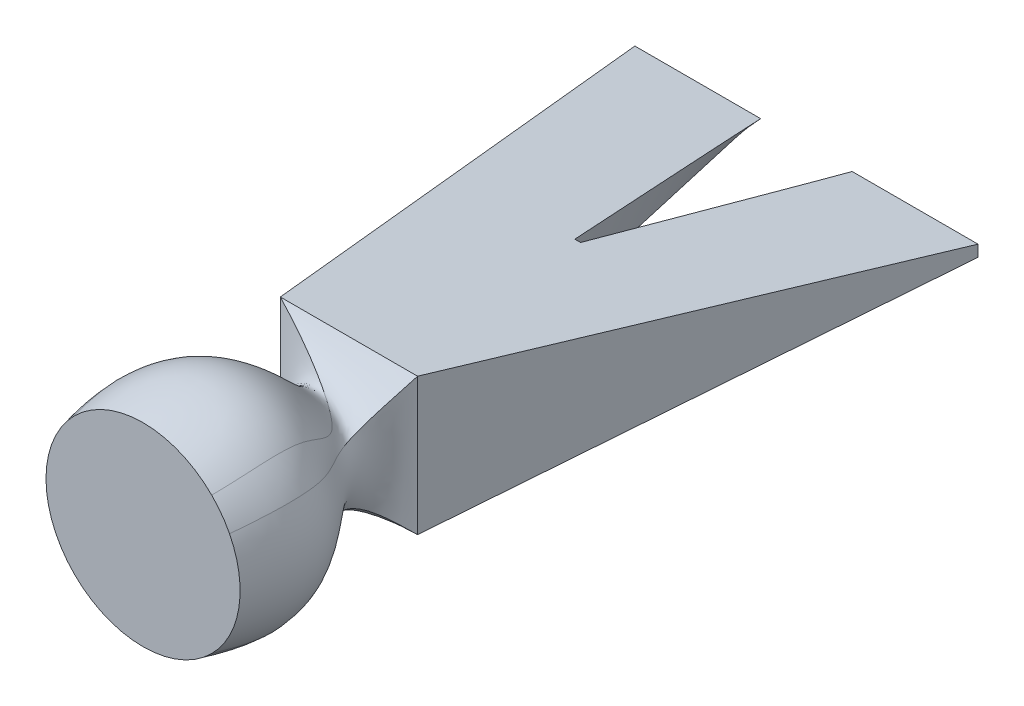
ISO-10303-21;
HEADER;
FILE_DESCRIPTION(('STEP AP214'),'2;1');
FILE_NAME('part.step','',(''),(''),'','','');
FILE_SCHEMA(('AUTOMOTIVE_DESIGN { 1 0 10303 214 1 1 1 1 }'));
ENDSEC;
DATA;
#1=APPLICATION_CONTEXT('core data for automotive mechanical design processes');
#2=APPLICATION_PROTOCOL_DEFINITION('international standard','automotive_design',2000,#1);
#3=PRODUCT_CONTEXT('',#1,'mechanical');
#4=PRODUCT('Part','Part','',(#3));
#5=PRODUCT_RELATED_PRODUCT_CATEGORY('part','',(#4));
#6=PRODUCT_DEFINITION_FORMATION('','',#4);
#7=PRODUCT_DEFINITION_CONTEXT('part definition',#1,'design');
#8=PRODUCT_DEFINITION('design','',#6,#7);
#9=PRODUCT_DEFINITION_SHAPE('','',#8);
#10=(LENGTH_UNIT() NAMED_UNIT(*) SI_UNIT(.MILLI.,.METRE.));
#11=(NAMED_UNIT(*) PLANE_ANGLE_UNIT() SI_UNIT($,.RADIAN.));
#12=(NAMED_UNIT(*) SI_UNIT($,.STERADIAN.) SOLID_ANGLE_UNIT());
#13=UNCERTAINTY_MEASURE_WITH_UNIT(LENGTH_MEASURE(1.E-05),#10,'distance_accuracy_value','');
#14=(GEOMETRIC_REPRESENTATION_CONTEXT(3) GLOBAL_UNCERTAINTY_ASSIGNED_CONTEXT((#13)) GLOBAL_UNIT_ASSIGNED_CONTEXT((#10,
#11,#12)) REPRESENTATION_CONTEXT('',''));
#15=CARTESIAN_POINT('',(0.,0.,0.));
#16=DIRECTION('',(0.,0.,1.));
#17=DIRECTION('',(1.,0.,0.));
#18=AXIS2_PLACEMENT_3D('',#15,#16,#17);
#19=CARTESIAN_POINT('',(0.,0.,-200.));
#20=DIRECTION('',(0.,0.,-1.));
#21=DIRECTION('',(-1.,0.,0.));
#22=AXIS2_PLACEMENT_3D('',#19,#20,#21);
#23=PLANE('',#22);
#24=DIRECTION('',(0.707106781186548,-0.707106781186547,0.));
#25=VECTOR('',#24,1.);
#26=CARTESIAN_POINT('',(25.,-2.5,-200.));
#27=LINE('',#26,#25);
#28=CARTESIAN_POINT('',(20.,2.5,-200.));
#29=VERTEX_POINT('',#28);
#30=CARTESIAN_POINT('',(25.,-2.5,-200.));
#31=VERTEX_POINT('',#30);
#32=EDGE_CURVE('E217',#29,#31,#27,.T.);
#33=ORIENTED_EDGE('',*,*,#32,.F.);
#34=DIRECTION('',(-1.,0.,0.));
#35=VECTOR('',#34,1.);
#36=CARTESIAN_POINT('',(-75.,2.5,-200.));
#37=LINE('',#36,#35);
#38=CARTESIAN_POINT('',(75.,2.5,-200.));
#39=VERTEX_POINT('',#38);
#40=EDGE_CURVE('E376',#39,#29,#37,.T.);
#41=ORIENTED_EDGE('',*,*,#40,.F.);
#42=DIRECTION('',(0.,1.,0.));
#43=VECTOR('',#42,1.);
#44=CARTESIAN_POINT('',(75.,-2.5,-200.));
#45=LINE('',#44,#43);
#46=CARTESIAN_POINT('',(75.,-2.5,-200.));
#47=VERTEX_POINT('',#46);
#48=EDGE_CURVE('E239',#47,#39,#45,.T.);
#49=ORIENTED_EDGE('',*,*,#48,.F.);
#50=DIRECTION('',(1.,0.,0.));
#51=VECTOR('',#50,1.);
#52=CARTESIAN_POINT('',(-75.,-2.5,-200.));
#53=LINE('',#52,#51);
#54=EDGE_CURVE('E140',#31,#47,#53,.T.);
#55=ORIENTED_EDGE('',*,*,#54,.F.);
#56=EDGE_LOOP('',(#33,#41,#49,#55));
#57=FACE_BOUND('',#56,.T.);
#58=ADVANCED_FACE('F135',(#57),#23,.T.);
#59=CARTESIAN_POINT('',(0.,0.,90.));
#60=DIRECTION('',(0.,0.,1.));
#61=DIRECTION('',(1.,0.,0.));
#62=AXIS2_PLACEMENT_3D('',#59,#60,#61);
#63=PLANE('',#62);
#64=CARTESIAN_POINT('',(0.,0.,90.));
#65=DIRECTION('',(0.,0.,1.));
#66=DIRECTION('',(1.,0.,0.));
#67=AXIS2_PLACEMENT_3D('',#64,#65,#66);
#68=CIRCLE('',#67,42.4264068711929);
#69=CARTESIAN_POINT('',(30.,-30.,90.));
#70=VERTEX_POINT('',#69);
#71=CARTESIAN_POINT('',(37.802205320103,19.2611856576062,90.));
#72=VERTEX_POINT('',#71);
#73=EDGE_CURVE('E306',#70,#72,#68,.T.);
#74=ORIENTED_EDGE('',*,*,#73,.T.);
#75=CARTESIAN_POINT('',(30.,30.,90.));
#76=VERTEX_POINT('',#75);
#77=EDGE_CURVE('E434',#72,#76,#68,.T.);
#78=ORIENTED_EDGE('',*,*,#77,.T.);
#79=CARTESIAN_POINT('',(-30.,30.,90.));
#80=VERTEX_POINT('',#79);
#81=EDGE_CURVE('E162',#76,#80,#68,.T.);
#82=ORIENTED_EDGE('',*,*,#81,.T.);
#83=EDGE_CURVE('E436',#80,#70,#68,.T.);
#84=ORIENTED_EDGE('',*,*,#83,.T.);
#85=EDGE_LOOP('',(#74,#78,#82,#84));
#86=FACE_BOUND('',#85,.T.);
#87=ADVANCED_FACE('F137',(#86),#63,.T.);
#88=CARTESIAN_POINT('',(30.,-30.,0.));
#89=CARTESIAN_POINT('',(21.7851130197758,-21.7851130197758,8.33333333333334));
#90=CARTESIAN_POINT('',(10.318060036557,-10.318060036557,21.3529609402473));
#91=CARTESIAN_POINT('',(35.9925378236792,-35.9925378236792,51.829840681137));
#92=CARTESIAN_POINT('',(32.3581604097574,-32.3581604097574,75.7725733783253));
#93=CARTESIAN_POINT('',(30.,-30.,90.));
#94=CARTESIAN_POINT('',(30.,-10.,0.));
#95=CARTESIAN_POINT('',(22.3565062022907,-8.04815958581926,8.22556761468494));
#96=CARTESIAN_POINT('',(17.836087357927,-7.34363097641756,21.3911769978607));
#97=CARTESIAN_POINT('',(50.7921365249769,-19.9767434360095,51.8167924581793));
#98=CARTESIAN_POINT('',(45.55583993278,-18.0741817082814,75.7725733783253));
#99=CARTESIAN_POINT('',(42.9932478375263,-17.0067521624737,90.));
#100=CARTESIAN_POINT('',(30.,10.,0.));
#101=CARTESIAN_POINT('',(22.9278993848056,5.68879384813727,8.11780189603654));
#102=CARTESIAN_POINT('',(19.5237270600727,-0.280369080483714,21.429393055474));
#103=CARTESIAN_POINT('',(54.3798885298079,3.90188442284275,51.8037442352217));
#104=CARTESIAN_POINT('',(48.9114077306492,3.1120395581098,75.7725733783253));
#105=CARTESIAN_POINT('',(46.1443839498992,2.88873823996773,90.));
#106=CARTESIAN_POINT('',(30.,30.,0.));
#107=CARTESIAN_POINT('',(23.4992925673205,19.4257472820938,8.01003617738814));
#108=CARTESIAN_POINT('',(14.4028197910098,4.69587056105987,21.4676091130874));
#109=CARTESIAN_POINT('',(44.8747915077265,23.7671644399179,51.790696012264));
#110=CARTESIAN_POINT('',(40.7736607863493,20.775217839698,75.7725733783253));
#111=CARTESIAN_POINT('',(37.802205320103,19.2611856576062,90.));
#112=B_SPLINE_SURFACE_WITH_KNOTS('',3,3,((#88,#89,#90,#91,#92,#93),(#94,#95,#96,#97,#98,#99),
(#100,#101,#102,#103,#104,#105),(#106,#107,#108,#109,#110,#111)),.UNSPECIFIED.,.F.,.F.,.F.,(4,
4),(4,1,1,4),(0.,1.),(0.,0.357643172453526,0.635409037528455,1.),.UNSPECIFIED.);
#113=DIRECTION('',(0.,1.,0.));
#114=VECTOR('',#113,1.);
#115=CARTESIAN_POINT('',(30.,30.,0.));
#116=LINE('',#115,#114);
#117=CARTESIAN_POINT('',(30.,-30.,0.));
#118=VERTEX_POINT('',#117);
#119=CARTESIAN_POINT('',(30.,30.,0.));
#120=VERTEX_POINT('',#119);
#121=EDGE_CURVE('E457',#118,#120,#116,.T.);
#122=CARTESIAN_POINT('',(30.,30.,0.));
#123=CARTESIAN_POINT('',(23.4992925673205,19.4257472820938,8.01003617738814));
#124=CARTESIAN_POINT('',(14.4028197910098,4.69587056105987,21.4676091130874));
#125=CARTESIAN_POINT('',(44.8747915077265,23.7671644399179,51.790696012264));
#126=CARTESIAN_POINT('',(40.7736607863493,20.775217839698,75.7725733783253));
#127=CARTESIAN_POINT('',(37.802205320103,19.2611856576062,90.));
#128=B_SPLINE_CURVE_WITH_KNOTS('',3,(#122,#123,#124,#125,#126,#127),.UNSPECIFIED.,.F.,.F.,(4,1,
1,4),(0.,0.357643172453526,0.635409037528455,1.),.UNSPECIFIED.);
#129=EDGE_CURVE('E449',#120,#72,#128,.T.);
#130=CARTESIAN_POINT('',(30.,-30.,0.));
#131=CARTESIAN_POINT('',(21.7851130197758,-21.7851130197758,8.33333333333334));
#132=CARTESIAN_POINT('',(10.318060036557,-10.318060036557,21.3529609402473));
#133=CARTESIAN_POINT('',(35.9925378236792,-35.9925378236792,51.829840681137));
#134=CARTESIAN_POINT('',(32.3581604097574,-32.3581604097574,75.7725733783253));
#135=CARTESIAN_POINT('',(30.,-30.,90.));
#136=B_SPLINE_CURVE_WITH_KNOTS('',3,(#130,#131,#132,#133,#134,#135),.UNSPECIFIED.,.F.,.F.,(4,1,
1,4),(0.,0.357643172453526,0.635409037528455,1.),.UNSPECIFIED.);
#137=EDGE_CURVE('E458',#70,#118,#136,.F.);
#138=ORIENTED_EDGE('',*,*,#121,.T.);
#139=ORIENTED_EDGE('',*,*,#129,.T.);
#140=ORIENTED_EDGE('',*,*,#73,.F.);
#141=ORIENTED_EDGE('',*,*,#137,.T.);
#142=EDGE_LOOP('',(#138,#139,#140,#141));
#143=FACE_BOUND('',#142,.T.);
#144=ADVANCED_FACE('F424',(#143),#112,.T.);
#145=CARTESIAN_POINT('',(30.,30.,0.));
#146=CARTESIAN_POINT('',(23.4992925673205,19.4257472820938,8.01003617738814));
#147=CARTESIAN_POINT('',(14.4028197910098,4.69587056105988,21.4676091130874));
#148=CARTESIAN_POINT('',(44.8747915077265,23.767164439918,51.790696012264));
#149=CARTESIAN_POINT('',(40.7736607863493,20.775217839698,75.7725733783253));
#150=CARTESIAN_POINT('',(37.802205320103,19.2611856576062,90.));
#151=CARTESIAN_POINT('',(10.,30.,0.));
#152=CARTESIAN_POINT('',(11.7687079402375,20.2122025279878,7.15180902556312));
#153=CARTESIAN_POINT('',(17.3418714400447,6.79925244432722,21.7719550469414));
#154=CARTESIAN_POINT('',(41.2231480755875,28.2832692535335,51.6867822689533));
#155=CARTESIAN_POINT('',(38.5480887905122,25.0233051217613,75.7725733783253));
#156=CARTESIAN_POINT('',(35.7810650097622,23.227896863781,90.));
#157=CARTESIAN_POINT('',(-10.,30.,0.));
#158=CARTESIAN_POINT('',(0.0381233131544709,20.9986577738818,6.29358187373809));
#159=CARTESIAN_POINT('',(19.9184237351305,8.6996761663137,22.0763009807954));
#160=CARTESIAN_POINT('',(36.8744176829446,32.4090851294848,51.5828685256426));
#161=CARTESIAN_POINT('',(35.7105919322357,28.9287844968869,75.7725733783253));
#162=CARTESIAN_POINT('',(33.147999836982,26.852000163018,90.));
#163=CARTESIAN_POINT('',(-30.,30.,0.));
#164=CARTESIAN_POINT('',(-11.6924613139285,21.7851130197758,5.43535472191306));
#165=CARTESIAN_POINT('',(22.1899328875746,10.318060036557,22.3806469146494));
#166=CARTESIAN_POINT('',(31.9390887355453,35.9925378236792,51.478954782332));
#167=CARTESIAN_POINT('',(32.3581604097574,32.3581604097574,75.7725733783253));
#168=CARTESIAN_POINT('',(30.,30.,90.));
#169=B_SPLINE_SURFACE_WITH_KNOTS('',3,3,((#145,#146,#147,#148,#149,#150),(#151,#152,#153,#154,
#155,#156),(#157,#158,#159,#160,#161,#162),(#163,#164,#165,#166,#167,#168)),.UNSPECIFIED.,.F.,
.F.,.F.,(4,4),(4,1,1,4),(0.,1.),(0.,0.357643172453526,0.635409037528455,1.),.UNSPECIFIED.);
#170=DIRECTION('',(-1.,0.,0.));
#171=VECTOR('',#170,1.);
#172=CARTESIAN_POINT('',(-30.,30.,0.));
#173=LINE('',#172,#171);
#174=CARTESIAN_POINT('',(-30.,30.,0.));
#175=VERTEX_POINT('',#174);
#176=EDGE_CURVE('E462',#120,#175,#173,.T.);
#177=CARTESIAN_POINT('',(-30.,30.,0.));
#178=CARTESIAN_POINT('',(-11.6924613139285,21.7851130197758,5.43535472191306));
#179=CARTESIAN_POINT('',(22.1899328875746,10.318060036557,22.3806469146494));
#180=CARTESIAN_POINT('',(31.9390887355453,35.9925378236792,51.478954782332));
#181=CARTESIAN_POINT('',(32.3581604097574,32.3581604097574,75.7725733783253));
#182=CARTESIAN_POINT('',(30.,30.,90.));
#183=B_SPLINE_CURVE_WITH_KNOTS('',3,(#177,#178,#179,#180,#181,#182),.UNSPECIFIED.,.F.,.F.,(4,1,
1,4),(0.,0.357643172453526,0.635409037528455,1.),.UNSPECIFIED.);
#184=EDGE_CURVE('E451',#175,#76,#183,.T.);
#185=ORIENTED_EDGE('',*,*,#176,.T.);
#186=ORIENTED_EDGE('',*,*,#184,.T.);
#187=ORIENTED_EDGE('',*,*,#77,.F.);
#188=ORIENTED_EDGE('',*,*,#129,.F.);
#189=EDGE_LOOP('',(#185,#186,#187,#188));
#190=FACE_BOUND('',#189,.T.);
#191=ADVANCED_FACE('F428',(#190),#169,.T.);
#192=CARTESIAN_POINT('',(-30.,-30.,0.));
#193=CARTESIAN_POINT('',(-21.7851130197758,-11.6924613139285,5.43535472191306));
#194=CARTESIAN_POINT('',(-10.318060036557,22.1899328875746,22.3806469146494));
#195=CARTESIAN_POINT('',(-35.9925378236792,31.9390887355453,51.478954782332));
#196=CARTESIAN_POINT('',(-32.3581604097574,32.3581604097574,75.7725733783253));
#197=CARTESIAN_POINT('',(-30.,30.,90.));
#198=CARTESIAN_POINT('',(-28.75,-30.,0.));
#199=CARTESIAN_POINT('',(-21.4250799179981,-11.9136042056297,5.56172453956754));
#200=CARTESIAN_POINT('',(-11.6891917549581,21.0226970938561,22.3358213121603));
#201=CARTESIAN_POINT('',(-38.2541650829449,29.6137384230546,51.494292189232));
#202=CARTESIAN_POINT('',(-34.5787647523038,30.1184524290234,75.7724681408561));
#203=CARTESIAN_POINT('',(-32.0696812872116,27.9303187127884,90.));
#204=CARTESIAN_POINT('',(-26.25,-30.,0.));
#205=CARTESIAN_POINT('',(-20.7050137144427,-12.3558899890319,5.81446417487652));
#206=CARTESIAN_POINT('',(-14.124988649817,18.4972442086042,22.2461701071822));
#207=CARTESIAN_POINT('',(-42.1878798357469,24.5955246537411,51.5249670030321));
#208=CARTESIAN_POINT('',(-38.5024838886244,25.3164557179984,75.7722576659177));
#209=CARTESIAN_POINT('',(-35.6915543128628,23.4683753888082,89.9999999999999));
#210=CARTESIAN_POINT('',(-22.5,-30.,0.));
#211=CARTESIAN_POINT('',(-19.455142954318,-13.3106182757976,6.20814671448988));
#212=CARTESIAN_POINT('',(-16.9013148483243,14.3723213474832,22.1065582247469));
#213=CARTESIAN_POINT('',(-46.3538986587226,16.2319556453705,51.5726445510033));
#214=CARTESIAN_POINT('',(-42.6814539066735,17.3091015226769,75.7722270514454));
#215=CARTESIAN_POINT('',(-39.5724177675082,16.0485402195271,90.0000000000001));
#216=CARTESIAN_POINT('',(-19.375,-30.,0.));
#217=CARTESIAN_POINT('',(-18.2689378034905,-14.2743483386525,6.52571963722546));
#218=CARTESIAN_POINT('',(-18.4893846731543,10.7540948939231,21.9939905595728));
#219=CARTESIAN_POINT('',(-48.3664739534656,8.79305485333897,51.6109434912539));
#220=CARTESIAN_POINT('',(-44.7757023586018,10.2072470782548,75.7726658470758));
#221=CARTESIAN_POINT('',(-41.5124193141265,9.46329576974967,90.));
#222=CARTESIAN_POINT('',(-16.875,-30.,0.));
#223=CARTESIAN_POINT('',(-17.2026498391207,-15.1423737812293,6.76614021617727));
#224=CARTESIAN_POINT('',(-19.3340192024752,7.81872518270874,21.9087524712993));
#225=CARTESIAN_POINT('',(-49.1008006241564,2.69467485253696,51.6399923638501));
#226=CARTESIAN_POINT('',(-45.6130171341809,4.39268708692885,75.7728416025735));
#227=CARTESIAN_POINT('',(-42.2888297754628,4.07252544283722,89.9999999999998));
#228=CARTESIAN_POINT('',(-15.,-30.,0.));
#229=CARTESIAN_POINT('',(-16.3390186171672,-15.8334636635734,6.93744457820094));
#230=CARTESIAN_POINT('',(-19.7571291529378,5.61360000577884,21.8480140932957));
#231=CARTESIAN_POINT('',(-49.2116411564082,-1.91661846917131,51.6607040593082));
#232=CARTESIAN_POINT('',(-45.8221300664945,0.000222600815622217,75.7729271441126));
#233=CARTESIAN_POINT('',(-42.482665395664,7.17972310241774E-05,90.0000000000002));
#234=CARTESIAN_POINT('',(-13.125,-30.,0.));
#235=CARTESIAN_POINT('',(-15.4051368844683,-16.5569044578781,7.09824405180598));
#236=CARTESIAN_POINT('',(-19.9719238229529,3.42320405112208,21.7909842948692));
#237=CARTESIAN_POINT('',(-48.8830578501964,-6.53322608714881,51.680194178374));
#238=CARTESIAN_POINT('',(-45.6130576899997,-4.39297151717433,75.7728679433914));
#239=CARTESIAN_POINT('',(-42.2888730631144,-4.07269116469179,89.9999999999999));
#240=CARTESIAN_POINT('',(-11.25,-30.,0.));
#241=CARTESIAN_POINT('',(-14.3957857533489,-17.3056773665368,7.24795057318741));
#242=CARTESIAN_POINT('',(-19.979911495624,1.25865356173705,21.7378758560051));
#243=CARTESIAN_POINT('',(-48.1131296093758,-11.1191278026458,51.6983787211688));
#244=CARTESIAN_POINT('',(-44.9847137807444,-8.75361440673265,75.7727007889089));
#245=CARTESIAN_POINT('',(-41.7063974506808,-8.11540897527283,90.0000000000001));
#246=CARTESIAN_POINT('',(-9.375,-30.,0.));
#247=CARTESIAN_POINT('',(-13.305997604914,-18.0724577212999,7.38659127967226));
#248=CARTESIAN_POINT('',(-19.7811987708197,-0.869500956289455,21.6886826295956));
#249=CARTESIAN_POINT('',(-46.9039276157339,-15.6368861735034,51.7152504804551));
#250=CARTESIAN_POINT('',(-43.9391614177116,-13.0473625633463,75.7724558447987));
#251=CARTESIAN_POINT('',(-40.736901682888,-12.0967865773679,90.));
#252=CARTESIAN_POINT('',(-7.5,-30.,0.));
#253=CARTESIAN_POINT('',(-12.1340164391323,-18.8416573806532,7.51325256345397));
#254=CARTESIAN_POINT('',(-19.3836492723217,-2.93147927879677,21.6437574237566));
#255=CARTESIAN_POINT('',(-45.2491643713599,-20.0596365604561,51.7306118383469));
#256=CARTESIAN_POINT('',(-42.4723599831856,-17.2463595585896,75.7723832051153));
#257=CARTESIAN_POINT('',(-39.3774467655611,-15.9891705440984,90.));
#258=CARTESIAN_POINT('',(-5.625,-30.,0.));
#259=CARTESIAN_POINT('',(-10.8724330990488,-19.611700824601,7.631087102225));
#260=CARTESIAN_POINT('',(-18.7731891250062,-4.93404223858393,21.601937920679));
#261=CARTESIAN_POINT('',(-43.1601509744461,-24.3392346529356,51.7449782639343));
#262=CARTESIAN_POINT('',(-40.5921271476079,-21.3094194017423,75.7720983966006));
#263=CARTESIAN_POINT('',(-37.6334375232526,-19.7570794963537,90.));
#264=CARTESIAN_POINT('',(-3.75,-30.,0.));
#265=CARTESIAN_POINT('',(-9.52946201060997,-20.3601115224047,7.73825147403759));
#266=CARTESIAN_POINT('',(-17.9802619190582,-6.83060353976834,21.5639752902735));
#267=CARTESIAN_POINT('',(-40.6144126395733,-28.463492796355,51.7578324079953));
#268=CARTESIAN_POINT('',(-38.2836634378676,-25.2192243605748,75.7724470045517));
#269=CARTESIAN_POINT('',(-35.4947850350991,-23.3802482282969,90.));
#270=CARTESIAN_POINT('',(-1.875,-30.,0.));
#271=CARTESIAN_POINT('',(-8.08505298569502,-21.099841274903,7.84265765023427));
#272=CARTESIAN_POINT('',(-16.9498142325337,-8.66216015698935,21.5269324766288));
#273=CARTESIAN_POINT('',(-37.653681464193,-32.3558765018372,51.7705285597685));
#274=CARTESIAN_POINT('',(-35.5750507237636,-28.9145279284696,75.7722897572561));
#275=CARTESIAN_POINT('',(-32.9806406400491,-26.8093223206901,90.));
#276=CARTESIAN_POINT('',(0.,-30.,0.));
#277=CARTESIAN_POINT('',(-6.56186485176625,-21.7949852599102,7.94048456561541));
#278=CARTESIAN_POINT('',(-15.7487227496751,-10.3471761281447,21.4922986005476));
#279=CARTESIAN_POINT('',(-34.2075001714083,-36.0517808365173,51.782199337367));
#280=CARTESIAN_POINT('',(-32.4147768489232,-32.4147300281615,75.7727901245605));
#281=CARTESIAN_POINT('',(-30.0525088021708,-30.0525087941342,90.));
#282=CARTESIAN_POINT('',(1.875,-30.,0.));
#283=CARTESIAN_POINT('',(-4.96166128924899,-22.4326505624264,8.03247838392354));
#284=CARTESIAN_POINT('',(-14.3853746984472,-11.8617064221434,21.4596185838867));
#285=CARTESIAN_POINT('',(-30.4017905018494,-39.3909244926359,51.7935100031538));
#286=CARTESIAN_POINT('',(-28.9145010143251,-35.5750664646825,75.7722953989097));
#287=CARTESIAN_POINT('',(-26.8093223031085,-32.9806406417833,90.));
#288=CARTESIAN_POINT('',(3.75,-30.,0.));
#289=CARTESIAN_POINT('',(-3.29185336573331,-23.0065914989871,8.11566103952746));
#290=CARTESIAN_POINT('',(-12.8842162782988,-13.2003076589387,21.4301369657071));
#291=CARTESIAN_POINT('',(-26.3966170153826,-42.246425526842,51.8035311537223));
#292=CARTESIAN_POINT('',(-25.2191359287296,-38.2837321926035,75.7724407620472));
#293=CARTESIAN_POINT('',(-23.3802482625157,-35.4947850389675,90.0000000000001));
#294=CARTESIAN_POINT('',(5.625,-30.,0.));
#295=CARTESIAN_POINT('',(-1.58567732391732,-23.4865800782549,8.18909674655001));
#296=CARTESIAN_POINT('',(-11.3262880700754,-14.3001432871908,21.4040560835436));
#297=CARTESIAN_POINT('',(-22.1567052176603,-44.6874026608614,51.8125404017659));
#298=CARTESIAN_POINT('',(-21.3094378709207,-40.5921068135891,75.7721024489815));
#299=CARTESIAN_POINT('',(-19.7570794316998,-37.6334375122226,90.));
#300=CARTESIAN_POINT('',(7.5,-30.,0.));
#301=CARTESIAN_POINT('',(0.169745594472853,-23.8921900926909,8.25753337070847));
#302=CARTESIAN_POINT('',(-9.67339412649119,-15.2138618509587,21.3798190780029));
#303=CARTESIAN_POINT('',(-17.7577265475552,-46.6728648505766,51.82072977599));
#304=CARTESIAN_POINT('',(-17.2463532156901,-42.4723682823614,75.7723810071448));
#305=CARTESIAN_POINT('',(-15.9891706652063,-39.3774467881902,90.));
#306=CARTESIAN_POINT('',(9.375,-30.,0.));
#307=CARTESIAN_POINT('',(1.95503766657752,-24.2098258637093,8.32093778682158));
#308=CARTESIAN_POINT('',(-7.97167321202984,-15.9144965703724,21.3573432234158));
#309=CARTESIAN_POINT('',(-13.2119695534838,-48.2241482132664,51.8283804194293));
#310=CARTESIAN_POINT('',(-13.0473635759548,-43.9391583030316,75.7724567083009));
#311=CARTESIAN_POINT('',(-12.0967863514858,-40.7369016396348,90.0000000000001));
#312=CARTESIAN_POINT('',(11.25,-30.,0.));
#313=CARTESIAN_POINT('',(3.77128595287964,-24.4438612508594,8.38105012592729));
#314=CARTESIAN_POINT('',(-6.2154774139897,-16.4166837697404,21.3360541803404));
#315=CARTESIAN_POINT('',(-8.56720646142128,-49.3297344536587,51.835573994635));
#316=CARTESIAN_POINT('',(-8.75363747097252,-44.9847098850106,75.7727004783304));
#317=CARTESIAN_POINT('',(-8.11540939263948,-41.7063975311531,89.9999999999999));
#318=CARTESIAN_POINT('',(13.125,-30.,0.));
#319=CARTESIAN_POINT('',(5.60535433696687,-24.5899707183147,8.43723049552906));
#320=CARTESIAN_POINT('',(-4.43590807182404,-16.7147973547619,21.3161507721929));
#321=CARTESIAN_POINT('',(-3.84986156514405,-49.9951485242225,51.8423178290002));
#322=CARTESIAN_POINT('',(-4.39298162802491,-45.6130561684351,75.7728685285251));
#323=CARTESIAN_POINT('',(-4.07269042354983,-42.2888729199382,90.0000000000001));
#324=CARTESIAN_POINT('',(15.,-30.,0.));
#325=CARTESIAN_POINT('',(7.45206965619301,-24.6472481926674,8.48911680569283));
#326=CARTESIAN_POINT('',(-2.64401986239036,-16.8108414813626,21.2977574732237));
#327=CARTESIAN_POINT('',(0.902801903095035,-50.2176009701044,51.8485799451224));
#328=CARTESIAN_POINT('',(0.000228225684802034,-45.8221311922064,75.7729267527848));
#329=CARTESIAN_POINT('',(7.07277070235643E-05,-42.4826656023617,89.9999999999999));
#330=CARTESIAN_POINT('',(16.875,-30.,0.));
#331=CARTESIAN_POINT('',(9.30595608705192,-24.6140929316296,8.53534390533463));
#332=CARTESIAN_POINT('',(-0.851222265345946,-16.705755200504,21.281354458908));
#333=CARTESIAN_POINT('',(5.65487895614394,-49.9981766750856,51.8542069334757));
#334=CARTESIAN_POINT('',(4.39269062375988,-45.6130176959977,75.7728409931227));
#335=CARTESIAN_POINT('',(4.07252488676809,-42.2888298832712,90.0000000000002));
#336=CARTESIAN_POINT('',(19.375,-30.,0.));
#337=CARTESIAN_POINT('',(11.7770860786523,-24.4480071133199,8.58633980723984));
#338=CARTESIAN_POINT('',(1.5157412120089,-16.2981641860336,21.2632501405226));
#339=CARTESIAN_POINT('',(11.9473700724712,-49.1146224514815,51.8604420638632));
#340=CARTESIAN_POINT('',(10.2072727013997,-44.7756955169454,75.7726668722176));
#341=CARTESIAN_POINT('',(9.46332266147588,-41.5124141118588,89.9999999999999));
#342=CARTESIAN_POINT('',(22.5,-30.,0.));
#343=CARTESIAN_POINT('',(14.8394768014697,-24.0017534347056,8.61733542548757));
#344=CARTESIAN_POINT('',(4.3896508640653,-15.2889804922855,21.2522076375198));
#345=CARTESIAN_POINT('',(19.6403471049797,-46.9044065821478,51.8643482887215));
#346=CARTESIAN_POINT('',(17.3090873097672,-42.681457961554,75.7722262117212));
#347=CARTESIAN_POINT('',(16.0485244654661,-39.5724208151299,90.0000000000001));
#348=CARTESIAN_POINT('',(26.25,-30.,0.));
#349=CARTESIAN_POINT('',(18.4335993535613,-23.1086386812106,8.58012465156535));
#350=CARTESIAN_POINT('',(7.57864532771381,-13.2726154826384,21.2654070610901));
#351=CARTESIAN_POINT('',(28.3235059143378,-42.4789061557871,51.8598317260949));
#352=CARTESIAN_POINT('',(25.3164631860356,-38.5024818118432,75.7722581192411));
#353=CARTESIAN_POINT('',(23.4683836689993,-35.691552711066,90.));
#354=CARTESIAN_POINT('',(28.75,-30.,0.));
#355=CARTESIAN_POINT('',(20.6679417977043,-22.2262882402541,8.41559710607734));
#356=CARTESIAN_POINT('',(9.46857526202926,-11.4050659146252,21.3237763138616));
#357=CARTESIAN_POINT('',(33.558696912981,-38.3511750680386,51.839837696123));
#358=CARTESIAN_POINT('',(30.1184521583054,-34.5787645939756,75.7724682919639));
#359=CARTESIAN_POINT('',(27.9303187127884,-32.0696812872116,90.));
#360=CARTESIAN_POINT('',(30.,-30.,0.));
#361=CARTESIAN_POINT('',(21.7851130197758,-21.7851130197758,8.33333333333334));
#362=CARTESIAN_POINT('',(10.318060036557,-10.318060036557,21.3529609402473));
#363=CARTESIAN_POINT('',(35.9925378236792,-35.9925378236792,51.829840681137));
#364=CARTESIAN_POINT('',(32.3581604097574,-32.3581604097574,75.7725733783253));
#365=CARTESIAN_POINT('',(30.,-30.,90.));
#366=B_SPLINE_SURFACE_WITH_KNOTS('',3,3,((#192,#193,#194,#195,#196,#197),(#198,#199,#200,#201,
#202,#203),(#204,#205,#206,#207,#208,#209),(#210,#211,#212,#213,#214,#215),(#216,#217,#218,#219,
#220,#221),(#222,#223,#224,#225,#226,#227),(#228,#229,#230,#231,#232,#233),(#234,#235,#236,#237,
#238,#239),(#240,#241,#242,#243,#244,#245),(#246,#247,#248,#249,#250,#251),(#252,#253,#254,#255,
#256,#257),(#258,#259,#260,#261,#262,#263),(#264,#265,#266,#267,#268,#269),(#270,#271,#272,#273,
#274,#275),(#276,#277,#278,#279,#280,#281),(#282,#283,#284,#285,#286,#287),(#288,#289,#290,#291,
#292,#293),(#294,#295,#296,#297,#298,#299),(#300,#301,#302,#303,#304,#305),(#306,#307,#308,#309,
#310,#311),(#312,#313,#314,#315,#316,#317),(#318,#319,#320,#321,#322,#323),(#324,#325,#326,#327,
#328,#329),(#330,#331,#332,#333,#334,#335),(#336,#337,#338,#339,#340,#341),(#342,#343,#344,#345,
#346,#347),(#348,#349,#350,#351,#352,#353),(#354,#355,#356,#357,#358,#359),(#360,#361,#362,#363,
#364,#365)),.UNSPECIFIED.,.F.,.F.,.F.,(4,1,1,1,1,1,1,1,1,1,1,1,1,1,1,1,1,1,1,1,1,1,1,1,1,1,4),
(4,1,1,4),(0.,0.0625,0.125,0.1875,0.21875,0.25,0.28125,0.3125,0.34375,0.375,0.40625,0.4375,
0.46875,0.5,0.53125,0.5625,0.59375,0.625,0.65625,0.6875,0.71875,0.75,0.78125,0.8125,0.875,
0.9375,1.),(0.,0.357643172453526,0.635409037528455,1.),.UNSPECIFIED.);
#367=DIRECTION('',(1.,0.,0.));
#368=VECTOR('',#367,1.);
#369=CARTESIAN_POINT('',(-30.,-30.,0.));
#370=LINE('',#369,#368);
#371=CARTESIAN_POINT('',(-30.,-30.,0.));
#372=VERTEX_POINT('',#371);
#373=EDGE_CURVE('E562',#372,#118,#370,.T.);
#374=CARTESIAN_POINT('',(-30.,-30.,0.));
#375=CARTESIAN_POINT('',(-21.7851130197758,-11.6924613139285,5.43535472191306));
#376=CARTESIAN_POINT('',(-10.318060036557,22.1899328875746,22.3806469146494));
#377=CARTESIAN_POINT('',(-35.9925378236792,31.9390887355453,51.478954782332));
#378=CARTESIAN_POINT('',(-32.3581604097574,32.3581604097574,75.7725733783253));
#379=CARTESIAN_POINT('',(-30.,30.,90.));
#380=B_SPLINE_CURVE_WITH_KNOTS('',3,(#374,#375,#376,#377,#378,#379),.UNSPECIFIED.,.F.,.F.,(4,1,
1,4),(0.,0.357643172453526,0.635409037528455,1.),.UNSPECIFIED.);
#381=EDGE_CURVE('E460',#372,#80,#380,.T.);
#382=ORIENTED_EDGE('',*,*,#373,.T.);
#383=ORIENTED_EDGE('',*,*,#137,.F.);
#384=ORIENTED_EDGE('',*,*,#83,.F.);
#385=ORIENTED_EDGE('',*,*,#381,.F.);
#386=EDGE_LOOP('',(#382,#383,#384,#385));
#387=FACE_BOUND('',#386,.T.);
#388=ADVANCED_FACE('F518',(#387),#366,.T.);
#389=CARTESIAN_POINT('',(-30.,30.,0.));
#390=CARTESIAN_POINT('',(-11.6924613139285,21.7851130197758,5.43535472191306));
#391=CARTESIAN_POINT('',(22.1899328875746,10.318060036557,22.3806469146494));
#392=CARTESIAN_POINT('',(31.9390887355453,35.9925378236792,51.478954782332));
#393=CARTESIAN_POINT('',(32.3581604097574,32.3581604097574,75.7725733783253));
#394=CARTESIAN_POINT('',(30.,30.,90.));
#395=CARTESIAN_POINT('',(-30.,10.,0.));
#396=CARTESIAN_POINT('',(-15.056678549211,10.6259215752077,5.43535472191306));
#397=CARTESIAN_POINT('',(13.3932739291346,24.0838510240248,22.3806469146494));
#398=CARTESIAN_POINT('',(13.2168654572217,53.5031527170023,51.478954782332));
#399=CARTESIAN_POINT('',(14.2286031722261,48.9156107074504,75.7725733783253));
#400=CARTESIAN_POINT('',(13.442549702307,46.557450297693,90.));
#401=CARTESIAN_POINT('',(-30.,-10.,0.));
#402=CARTESIAN_POINT('',(-18.4208957844934,-0.533269869360429,5.43535472191306));
#403=CARTESIAN_POINT('',(-1.52140107811699,28.041141974364,22.3806469146494));
#404=CARTESIAN_POINT('',(-17.2703145453555,52.1520030209577,51.478954782332));
#405=CARTESIAN_POINT('',(-14.2286031722261,48.9156107074504,75.7725733783253));
#406=CARTESIAN_POINT('',(-13.442549702307,46.557450297693,90.));
#407=CARTESIAN_POINT('',(-30.,-30.,0.));
#408=CARTESIAN_POINT('',(-21.7851130197758,-11.6924613139285,5.43535472191306));
#409=CARTESIAN_POINT('',(-10.318060036557,22.1899328875746,22.3806469146494));
#410=CARTESIAN_POINT('',(-35.9925378236792,31.9390887355453,51.478954782332));
#411=CARTESIAN_POINT('',(-32.3581604097574,32.3581604097574,75.7725733783253));
#412=CARTESIAN_POINT('',(-30.,30.,90.));
#413=B_SPLINE_SURFACE_WITH_KNOTS('',3,3,((#389,#390,#391,#392,#393,#394),(#395,#396,#397,#398,
#399,#400),(#401,#402,#403,#404,#405,#406),(#407,#408,#409,#410,#411,#412)),.UNSPECIFIED.,.F.,
.F.,.F.,(4,4),(4,1,1,4),(0.,1.),(0.,0.357643172453526,0.635409037528455,1.),.UNSPECIFIED.);
#414=DIRECTION('',(0.,-1.,0.));
#415=VECTOR('',#414,1.);
#416=CARTESIAN_POINT('',(-30.,30.,0.));
#417=LINE('',#416,#415);
#418=EDGE_CURVE('E560',#175,#372,#417,.T.);
#419=ORIENTED_EDGE('',*,*,#418,.T.);
#420=ORIENTED_EDGE('',*,*,#381,.T.);
#421=ORIENTED_EDGE('',*,*,#81,.F.);
#422=ORIENTED_EDGE('',*,*,#184,.F.);
#423=EDGE_LOOP('',(#419,#420,#421,#422));
#424=FACE_BOUND('',#423,.T.);
#425=ADVANCED_FACE('F269',(#424),#413,.T.);
#426=DIRECTION('',(0.707106781186548,0.707106781186547,0.));
#427=VECTOR('',#426,1.);
#428=CARTESIAN_POINT('',(-20.,2.50000000000001,-200.));
#429=LINE('',#428,#427);
#430=CARTESIAN_POINT('',(-25.,-2.49999999999999,-200.));
#431=VERTEX_POINT('',#430);
#432=CARTESIAN_POINT('',(-20.,2.5,-200.));
#433=VERTEX_POINT('',#432);
#434=EDGE_CURVE('E154',#431,#433,#429,.T.);
#435=ORIENTED_EDGE('',*,*,#434,.F.);
#436=CARTESIAN_POINT('',(-75.,-2.5,-200.));
#437=VERTEX_POINT('',#436);
#438=EDGE_CURVE('E241',#437,#431,#53,.T.);
#439=ORIENTED_EDGE('',*,*,#438,.F.);
#440=DIRECTION('',(0.,-1.,0.));
#441=VECTOR('',#440,1.);
#442=CARTESIAN_POINT('',(-75.,-2.5,-200.));
#443=LINE('',#442,#441);
#444=CARTESIAN_POINT('',(-75.,2.5,-200.));
#445=VERTEX_POINT('',#444);
#446=EDGE_CURVE('E255',#445,#437,#443,.T.);
#447=ORIENTED_EDGE('',*,*,#446,.F.);
#448=EDGE_CURVE('E301',#433,#445,#37,.T.);
#449=ORIENTED_EDGE('',*,*,#448,.F.);
#450=EDGE_LOOP('',(#435,#439,#447,#449));
#451=FACE_BOUND('',#450,.T.);
#452=ADVANCED_FACE('F258',(#451),#23,.T.);
#453=CARTESIAN_POINT('',(28.5544318857823,0.,6.42474717430101));
#454=DIRECTION('',(-0.975609756097561,0.,-0.219512195121951));
#455=DIRECTION('',(-0.219512195121951,0.,0.975609756097561));
#456=AXIS2_PLACEMENT_3D('',#453,#454,#455);
#457=PLANE('',#456);
#458=DIRECTION('',(-0.217563370783763,0.132955393256744,0.966948314594504));
#459=VECTOR('',#458,1.);
#460=CARTESIAN_POINT('',(75.,2.5,-200.));
#461=LINE('',#460,#459);
#462=EDGE_CURVE('E368',#39,#120,#461,.T.);
#463=ORIENTED_EDGE('',*,*,#462,.T.);
#464=ORIENTED_EDGE('',*,*,#121,.F.);
#465=DIRECTION('',(-0.217563370783763,-0.132955393256744,0.966948314594504));
#466=VECTOR('',#465,1.);
#467=CARTESIAN_POINT('',(75.,-2.5,-200.));
#468=LINE('',#467,#466);
#469=EDGE_CURVE('E606',#47,#118,#468,.T.);
#470=ORIENTED_EDGE('',*,*,#469,.F.);
#471=ORIENTED_EDGE('',*,*,#48,.T.);
#472=EDGE_LOOP('',(#463,#464,#470,#471));
#473=FACE_BOUND('',#472,.T.);
#474=ADVANCED_FACE('F268',(#473),#457,.F.);
#475=CARTESIAN_POINT('',(0.,-29.4433369115166,-4.04845882533354));
#476=DIRECTION('',(0.,0.990678839845296,0.136218340478728));
#477=DIRECTION('',(0.,-0.136218340478728,0.990678839845296));
#478=AXIS2_PLACEMENT_3D('',#475,#476,#477);
#479=PLANE('',#478);
#480=DIRECTION('',(1.,0.,0.));
#481=VECTOR('',#480,1.);
#482=CARTESIAN_POINT('',(0.,-16.25,-100.));
#483=LINE('',#482,#481);
#484=CARTESIAN_POINT('',(-12.864439277084,-16.25,-100.));
#485=VERTEX_POINT('',#484);
#486=CARTESIAN_POINT('',(12.864439277084,-16.25,-100.));
#487=VERTEX_POINT('',#486);
#488=EDGE_CURVE('E234',#485,#487,#483,.T.);
#489=ORIENTED_EDGE('',*,*,#488,.T.);
#490=CARTESIAN_POINT('',(12.864439277084,-16.25,-100.));
#491=CARTESIAN_POINT('',(13.601729971373,-15.4122355107147,-106.092832649348));
#492=CARTESIAN_POINT('',(14.3390482914644,-14.5744714719259,-112.185662022357));
#493=CARTESIAN_POINT('',(15.8138737382443,-12.8989465012539,-124.371298172699));
#494=CARTESIAN_POINT('',(16.5513808649276,-12.0611855693706,-130.464104950032));
#495=CARTESIAN_POINT('',(17.6578833582234,-10.8045481196973,-139.603286402202));
#496=CARTESIAN_POINT('',(18.026757824235,-10.3856696266571,-142.649675442494));
#497=CARTESIAN_POINT('',(18.7646271513914,-9.54791460106915,-148.742439264952));
#498=CARTESIAN_POINT('',(19.1336220125383,-9.1290380685215,-151.788814047116));
#499=CARTESIAN_POINT('',(19.8717904513539,-8.29128791921765,-157.88154240569));
#500=CARTESIAN_POINT('',(20.240964029025,-7.87241430246148,-160.927895982098));
#501=CARTESIAN_POINT('',(20.7949427118438,-7.24410745874198,-165.497400300058));
#502=CARTESIAN_POINT('',(20.9796386545833,-7.03467244588997,-167.020564029891));
#503=CARTESIAN_POINT('',(21.3491274297322,-6.61580400159875,-170.066879988373));
#504=CARTESIAN_POINT('',(21.5339202621435,-6.40637057015957,-171.590032217021));
#505=CARTESIAN_POINT('',(21.990727306473,-5.88883560448201,-175.353922876495));
#506=CARTESIAN_POINT('',(22.2628167243921,-5.5807353018926,-177.594652349872));
#507=CARTESIAN_POINT('',(22.8074466046413,-4.96454211084672,-182.07605737566));
#508=CARTESIAN_POINT('',(23.0799870669419,-4.65644922238977,-184.316732928074));
#509=CARTESIAN_POINT('',(23.4894226022733,-4.19432011814661,-187.677671868025));
#510=CARTESIAN_POINT('',(23.6260052724237,-4.0402787678181,-188.797972597687));
#511=CARTESIAN_POINT('',(23.8994763450395,-3.73220111056937,-191.038537377677));
#512=CARTESIAN_POINT('',(24.0363647474899,-3.57816480364889,-192.158801428008));
#513=CARTESIAN_POINT('',(24.3105798183869,-3.27009938225789,-194.399277219943));
#514=CARTESIAN_POINT('',(24.44790648694,-3.11607026778913,-195.519488961534));
#515=CARTESIAN_POINT('',(24.7233113186805,-2.80802448347578,-197.759821938358));
#516=CARTESIAN_POINT('',(24.8613894819973,-2.65400781363335,-198.879943173576));
#517=CARTESIAN_POINT('',(25.,-2.5,-200.));
#518=B_SPLINE_CURVE_WITH_KNOTS('',3,(#490,#491,#492,#493,#494,#495,#496,#497,#498,#499,#500,
#501,#502,#503,#504,#505,#506,#507,#508,#509,#510,#511,#512,#513,#514,#515,#516,#517),
.UNSPECIFIED.,.F.,.F.,(4,2,2,2,2,2,2,2,2,2,2,2,2,4),(0.,18.5825861947909,37.165171885134,
46.4564647824041,55.7477578347856,65.0390510148774,69.6846973911467,74.3303438634316,
81.164701399462,87.9990584886058,91.4162379347976,94.8334172136178,98.2505973232034,
101.66777802143),.UNSPECIFIED.);
#519=EDGE_CURVE('E221',#487,#31,#518,.T.);
#520=ORIENTED_EDGE('',*,*,#519,.T.);
#521=ORIENTED_EDGE('',*,*,#54,.T.);
#522=ORIENTED_EDGE('',*,*,#469,.T.);
#523=ORIENTED_EDGE('',*,*,#373,.F.);
#524=DIRECTION('',(0.217563370783763,-0.132955393256744,0.966948314594504));
#525=VECTOR('',#524,1.);
#526=CARTESIAN_POINT('',(-75.,-2.5,-200.));
#527=LINE('',#526,#525);
#528=EDGE_CURVE('E402',#437,#372,#527,.T.);
#529=ORIENTED_EDGE('',*,*,#528,.F.);
#530=ORIENTED_EDGE('',*,*,#438,.T.);
#531=CARTESIAN_POINT('',(-25.,-2.5,-200.));
#532=CARTESIAN_POINT('',(-24.9119498295606,-2.59780786486068,-199.28867007374));
#533=CARTESIAN_POINT('',(-24.8241352863536,-2.69561965641916,-198.577311589679));
#534=CARTESIAN_POINT('',(-24.6488668569747,-2.89124922688197,-197.154551077222));
#535=CARTESIAN_POINT('',(-24.561412970768,-2.98906700578573,-196.443149048831));
#536=CARTESIAN_POINT('',(-24.2994264104068,-3.2825265143624,-194.308898077364));
#537=CARTESIAN_POINT('',(-24.1252688000805,-3.47817445424502,-192.886003969127));
#538=CARTESIAN_POINT('',(-23.7775257268595,-3.8694797099353,-190.040147564107));
#539=CARTESIAN_POINT('',(-23.6039402638188,-4.06513702574056,-188.617185267341));
#540=CARTESIAN_POINT('',(-23.2571336892671,-4.45645765984718,-185.771217019293));
#541=CARTESIAN_POINT('',(-23.0839125777778,-4.65212097814889,-184.348211068008));
#542=CARTESIAN_POINT('',(-22.5646055394098,-5.23911637948284,-180.079153603761));
#543=CARTESIAN_POINT('',(-22.218875557846,-5.63045430435148,-177.233059604717));
#544=CARTESIAN_POINT('',(-21.5278936869501,-6.41313801397056,-171.540814443851));
#545=CARTESIAN_POINT('',(-21.1826417976565,-6.80448379872163,-168.694663282025));
#546=CARTESIAN_POINT('',(-20.1721630699653,-7.95033048116018,-160.36123286429));
#547=CARTESIAN_POINT('',(-19.5073082133108,-8.70483746530575,-154.873909343231));
#548=CARTESIAN_POINT('',(-18.1780239414175,-10.2138583554561,-143.899211960319));
#549=CARTESIAN_POINT('',(-17.5135945261625,-10.9683722614606,-138.411838098468));
#550=CARTESIAN_POINT('',(-16.1849675629482,-12.4774038751219,-127.437062726386));
#551=CARTESIAN_POINT('',(-15.5207700149931,-13.2319215827788,-121.949661216154));
#552=CARTESIAN_POINT('',(-14.1925187614267,-14.7409593751107,-110.974840908286));
#553=CARTESIAN_POINT('',(-13.5284650558207,-15.4954794597859,-105.487422110648));
#554=CARTESIAN_POINT('',(-12.864439277084,-16.25,-100.));
#555=B_SPLINE_CURVE_WITH_KNOTS('',3,(#531,#532,#533,#534,#535,#536,#537,#538,#539,#540,#541,
#542,#543,#544,#545,#546,#547,#548,#549,#550,#551,#552,#553,#554),.UNSPECIFIED.,.F.,.F.,(4,2,2,
2,2,2,2,2,2,2,2,4),(0.,2.17020383410687,4.34040745914215,8.68081385844398,13.0212191503608,
17.3616247012176,26.0424270313303,34.7232300593157,51.4593672419446,68.1955037804508,
84.9316406127609,101.667778050082),.UNSPECIFIED.);
#556=EDGE_CURVE('E235',#431,#485,#555,.T.);
#557=ORIENTED_EDGE('',*,*,#556,.T.);
#558=EDGE_LOOP('',(#489,#520,#521,#522,#523,#529,#530,#557));
#559=FACE_BOUND('',#558,.T.);
#560=ADVANCED_FACE('F230',(#559),#479,.F.);
#561=CARTESIAN_POINT('',(0.,29.4433369115166,-4.04845882533354));
#562=DIRECTION('',(0.,-0.990678839845296,0.136218340478728));
#563=DIRECTION('',(0.,-0.136218340478728,-0.990678839845296));
#564=AXIS2_PLACEMENT_3D('',#561,#562,#563);
#565=PLANE('',#564);
#566=ORIENTED_EDGE('',*,*,#40,.T.);
#567=CARTESIAN_POINT('',(20.,2.5,-200.));
#568=CARTESIAN_POINT('',(19.9181525370428,2.56474375551099,-199.529136323557));
#569=CARTESIAN_POINT('',(19.8357153082197,2.62947360751689,-199.058373763514));
#570=CARTESIAN_POINT('',(19.6698706348247,2.75891015989571,-198.11701701894));
#571=CARTESIAN_POINT('',(19.5864631916349,2.82361686030146,-197.646422834171));
#572=CARTESIAN_POINT('',(19.4188878630656,2.95301141498911,-196.705371527352));
#573=CARTESIAN_POINT('',(19.3347199839717,3.01769926942222,-196.234914404202));
#574=CARTESIAN_POINT('',(19.1657627855915,3.14705993901883,-195.294109534409));
#575=CARTESIAN_POINT('',(19.0809734660487,3.2117327541761,-194.82376178781));
#576=CARTESIAN_POINT('',(18.8258471094944,3.40573249169281,-193.41285460587));
#577=CARTESIAN_POINT('',(18.6547514242168,3.53504089882264,-192.472429826745));
#578=CARTESIAN_POINT('',(18.311153017903,3.79362187620083,-190.591840900358));
#579=CARTESIAN_POINT('',(18.1386503084025,3.92289444673403,-189.651676751025));
#580=CARTESIAN_POINT('',(17.7926168486733,4.1814142756188,-187.771532540954));
#581=CARTESIAN_POINT('',(17.6190860966645,4.31066153392615,-186.831552480537));
#582=CARTESIAN_POINT('',(17.2712532834796,4.56913685640745,-184.9517319534));
#583=CARTESIAN_POINT('',(17.0969512218681,4.69836492057054,-184.01189148676));
#584=CARTESIAN_POINT('',(16.6604657290878,5.02141075426007,-181.662467241745));
#585=CARTESIAN_POINT('',(16.3979132393965,5.21521926931714,-180.252950768603));
#586=CARTESIAN_POINT('',(15.8718807138155,5.60281279535099,-177.434088761084));
#587=CARTESIAN_POINT('',(15.6084006785372,5.7965978063432,-176.024743226595));
#588=CARTESIAN_POINT('',(15.0807622490731,6.18415121329755,-173.2061729942));
#589=CARTESIAN_POINT('',(14.8166038531115,6.37791960921483,-171.796948296619));
#590=CARTESIAN_POINT('',(14.2877769572095,6.76544352080637,-168.978592575954));
#591=CARTESIAN_POINT('',(14.0231084571698,6.95919903647812,-167.569461552886));
#592=CARTESIAN_POINT('',(13.2399914802884,7.5320601554606,-163.403198869378));
#593=CARTESIAN_POINT('',(12.7209944767294,7.91115184386654,-160.646168408243));
#594=CARTESIAN_POINT('',(11.68206060244,8.66931129508115,-155.132281490319));
#595=CARTESIAN_POINT('',(11.162123731751,9.04837905789085,-152.375425033521));
#596=CARTESIAN_POINT('',(9.60137814604861,10.1855576259782,-144.105035447432));
#597=CARTESIAN_POINT('',(8.55963325755603,10.9436445873109,-138.591675728648));
#598=CARTESIAN_POINT('',(6.47487702930724,12.4597866081018,-127.565188304715));
#599=CARTESIAN_POINT('',(5.43186568886309,13.2178416675423,-122.052060599692));
#600=CARTESIAN_POINT('',(3.86677633336252,14.3549100658183,-113.782472248594));
#601=CARTESIAN_POINT('',(3.34498420662247,14.733930706345,-111.025958499309));
#602=CARTESIAN_POINT('',(2.30124630920644,15.4919680617441,-105.512959550952));
#603=CARTESIAN_POINT('',(1.77930053853058,15.8709847766165,-102.75647435188));
#604=CARTESIAN_POINT('',(1.25729641994115,16.25,-100.));
#605=B_SPLINE_CURVE_WITH_KNOTS('',3,(#567,#568,#569,#570,#571,#572,#573,#574,#575,#576,#577,
#578,#579,#580,#581,#582,#583,#584,#585,#586,#587,#588,#589,#590,#591,#592,#593,#594,#595,#596,
#597,#598,#599,#600,#601,#602,#603,#604),.UNSPECIFIED.,.F.,.F.,(4,2,2,2,2,2,2,2,2,2,2,2,2,2,2,2,
2,2,4),(0.,1.44686803285594,2.89373400488823,4.34058802865321,5.78744265002009,8.68114758234961,
11.5748288140671,14.4685150574185,17.3622029343017,21.7026045146318,26.0430032346278,
30.3834133287194,34.7238242682929,43.2166779169838,51.709531191308,68.6952181058866,
85.6809142512942,94.1737715671671,102.666628877185),.UNSPECIFIED.);
#606=CARTESIAN_POINT('',(1.25729641994116,16.25,-100.));
#607=VERTEX_POINT('',#606);
#608=EDGE_CURVE('E12',#29,#607,#605,.T.);
#609=ORIENTED_EDGE('',*,*,#608,.T.);
#610=DIRECTION('',(-1.,0.,0.));
#611=VECTOR('',#610,1.);
#612=CARTESIAN_POINT('',(0.,16.25,-100.));
#613=LINE('',#612,#611);
#614=CARTESIAN_POINT('',(-1.25729641994115,16.25,-100.));
#615=VERTEX_POINT('',#614);
#616=EDGE_CURVE('E146',#607,#615,#613,.T.);
#617=ORIENTED_EDGE('',*,*,#616,.T.);
#618=CARTESIAN_POINT('',(-1.25729641994116,16.25,-100.));
#619=CARTESIAN_POINT('',(-1.82837687515755,15.8353524330825,-103.015618668491));
#620=CARTESIAN_POINT('',(-2.39938576730042,15.4207030378888,-106.031250633536));
#621=CARTESIAN_POINT('',(-3.54121541042383,14.591399440042,-112.062549526967));
#622=CARTESIAN_POINT('',(-4.11203616140399,14.176745237389,-115.078216455353));
#623=CARTESIAN_POINT('',(-5.824147807211,12.9327743260791,-124.125277628515));
#624=CARTESIAN_POINT('',(-6.96508896500176,12.1034486824179,-130.156736855142));
#625=CARTESIAN_POINT('',(-8.67519910892014,10.8594269477599,-139.204167652655));
#626=CARTESIAN_POINT('',(-9.24501893606882,10.4447474588236,-142.220018481283));
#627=CARTESIAN_POINT('',(-10.3840295123186,9.61537224591792,-148.251838211506));
#628=CARTESIAN_POINT('',(-10.9532202611256,9.20067652194114,-151.267807113155));
#629=CARTESIAN_POINT('',(-11.8062970329673,8.57861478318697,-155.791892485913));
#630=CARTESIAN_POINT('',(-12.0905377990624,8.37125779558898,-157.299943304807));
#631=CARTESIAN_POINT('',(-12.6587197815587,7.95653624139451,-160.316100062585));
#632=CARTESIAN_POINT('',(-12.9426609980113,7.74917167479933,-161.824206001459));
#633=CARTESIAN_POINT('',(-13.5101619522177,7.33443311819068,-164.840486413159));
#634=CARTESIAN_POINT('',(-13.7937216904394,7.12705912818909,-166.348660885898));
#635=CARTESIAN_POINT('',(-14.3603444507975,6.71229842408938,-169.365102370259));
#636=CARTESIAN_POINT('',(-14.6434074726322,6.50491170998359,-170.873369381938));
#637=CARTESIAN_POINT('',(-15.2135582281951,6.08668191416187,-173.915040624277));
#638=CARTESIAN_POINT('',(-15.5006348540713,5.87583855140741,-175.448446898855));
#639=CARTESIAN_POINT('',(-16.0738372934819,5.45412794177518,-178.515433150726));
#640=CARTESIAN_POINT('',(-16.3599631074905,5.24326069490937,-180.049013127932));
#641=CARTESIAN_POINT('',(-16.9308387683277,4.8214920770555,-183.116421257778));
#642=CARTESIAN_POINT('',(-17.2155886179612,4.6105907061379,-184.650249409906));
#643=CARTESIAN_POINT('',(-17.7830177798109,4.18873454167526,-187.718294242362));
#644=CARTESIAN_POINT('',(-18.0656970763458,3.9777797477381,-189.252510925541));
#645=CARTESIAN_POINT('',(-18.4871531673591,3.66128403338818,-191.554297938995));
#646=CARTESIAN_POINT('',(-18.6272114952963,3.55577479365449,-192.321637864331));
#647=CARTESIAN_POINT('',(-18.9061821154942,3.34472828976279,-193.856521528998));
#648=CARTESIAN_POINT('',(-19.0450944088347,3.23919102563128,-194.624065268136));
#649=CARTESIAN_POINT('',(-19.3213695128938,3.02807756111179,-196.159435919187));
#650=CARTESIAN_POINT('',(-19.4587323059348,2.92250136029376,-196.927262834227));
#651=CARTESIAN_POINT('',(-19.6631296600203,2.76409744232177,-198.079291328569));
#652=CARTESIAN_POINT('',(-19.7309877449312,2.71128944990397,-198.463349455244));
#653=CARTESIAN_POINT('',(-19.8660302825934,2.60565743874312,-199.231582263686));
#654=CARTESIAN_POINT('',(-19.933214734705,2.55283341998491,-199.615756945564));
#655=CARTESIAN_POINT('',(-20.,2.50000000000001,-200.));
#656=B_SPLINE_CURVE_WITH_KNOTS('',3,(#618,#619,#620,#621,#622,#623,#624,#625,#626,#627,#628,
#629,#630,#631,#632,#633,#634,#635,#636,#637,#638,#639,#640,#641,#642,#643,#644,#645,#646,#647,
#648,#649,#650,#651,#652,#653,#654,#655),.UNSPECIFIED.,.F.,.F.,(4,2,2,2,2,2,2,2,2,2,2,2,2,2,2,2,
2,2,4),(0.,9.291296615997,18.5825932508641,37.1651723666236,46.4564633818459,55.7477587397122,
60.3934086237908,65.0390577124689,69.6847010983648,74.330347307284,79.053039613849,
83.7757295653849,88.4984098859304,93.2211259367717,95.582487588689,97.9438470155449,
100.305233354889,101.485930263097,102.666628292407),.UNSPECIFIED.);
#657=EDGE_CURVE('E304',#615,#433,#656,.T.);
#658=ORIENTED_EDGE('',*,*,#657,.T.);
#659=ORIENTED_EDGE('',*,*,#448,.T.);
#660=DIRECTION('',(0.217563370783763,0.132955393256744,0.966948314594504));
#661=VECTOR('',#660,1.);
#662=CARTESIAN_POINT('',(-75.,2.5,-200.));
#663=LINE('',#662,#661);
#664=EDGE_CURVE('E604',#445,#175,#663,.T.);
#665=ORIENTED_EDGE('',*,*,#664,.T.);
#666=ORIENTED_EDGE('',*,*,#176,.F.);
#667=ORIENTED_EDGE('',*,*,#462,.F.);
#668=EDGE_LOOP('',(#566,#609,#617,#658,#659,#665,#666,#667));
#669=FACE_BOUND('',#668,.T.);
#670=ADVANCED_FACE('F315',(#669),#565,.F.);
#671=CARTESIAN_POINT('',(-28.5544318857823,0.,6.42474717430101));
#672=DIRECTION('',(0.975609756097561,0.,-0.219512195121951));
#673=DIRECTION('',(-0.219512195121951,0.,-0.975609756097561));
#674=AXIS2_PLACEMENT_3D('',#671,#672,#673);
#675=PLANE('',#674);
#676=ORIENTED_EDGE('',*,*,#528,.T.);
#677=ORIENTED_EDGE('',*,*,#418,.F.);
#678=ORIENTED_EDGE('',*,*,#664,.F.);
#679=ORIENTED_EDGE('',*,*,#446,.T.);
#680=EDGE_LOOP('',(#676,#677,#678,#679));
#681=FACE_BOUND('',#680,.T.);
#682=ADVANCED_FACE('F418',(#681),#675,.F.);
#683=CARTESIAN_POINT('',(0.,0.,-100.));
#684=DIRECTION('',(0.,0.,1.));
#685=DIRECTION('',(1.,0.,0.));
#686=AXIS2_PLACEMENT_3D('',#683,#684,#685);
#687=PLANE('',#686);
#688=DIRECTION('',(-0.336336396998156,-0.941741911594838,0.));
#689=VECTOR('',#688,1.);
#690=CARTESIAN_POINT('',(-0.5,18.3704299758352,-100.));
#691=LINE('',#690,#689);
#692=EDGE_CURVE('E359',#615,#485,#691,.T.);
#693=ORIENTED_EDGE('',*,*,#692,.F.);
#694=ORIENTED_EDGE('',*,*,#616,.F.);
#695=DIRECTION('',(-0.336336396998156,0.941741911594838,0.));
#696=VECTOR('',#695,1.);
#697=CARTESIAN_POINT('',(13.,-16.6295700241648,-100.));
#698=LINE('',#697,#696);
#699=EDGE_CURVE('E246',#487,#607,#698,.T.);
#700=ORIENTED_EDGE('',*,*,#699,.F.);
#701=ORIENTED_EDGE('',*,*,#488,.F.);
#702=EDGE_LOOP('',(#693,#694,#700,#701));
#703=FACE_BOUND('',#702,.T.);
#704=ADVANCED_FACE('F271',(#703),#687,.F.);
#705=CARTESIAN_POINT('',(25.,-2.5,-200.));
#706=CARTESIAN_POINT('',(13.,-16.6295700241648,-100.));
#707=CARTESIAN_POINT('',(24.1666666666667,-1.6666666666667,-200.));
#708=CARTESIAN_POINT('',(10.9166666666667,-10.7962366908314,-100.));
#709=CARTESIAN_POINT('',(23.3333333333334,-0.833333333333389,-200.));
#710=CARTESIAN_POINT('',(8.83333333333332,-4.96290335749806,-100.));
#711=CARTESIAN_POINT('',(21.6666666666667,0.833333333333277,-200.));
#712=CARTESIAN_POINT('',(4.66666666666666,6.70376330916861,-100.));
#713=CARTESIAN_POINT('',(20.8333333333334,1.66666666666663,-200.));
#714=CARTESIAN_POINT('',(2.58333333333333,12.5370966425019,-100.));
#715=CARTESIAN_POINT('',(20.,2.5,-200.));
#716=CARTESIAN_POINT('',(0.5,18.3704299758352,-100.));
#717=B_SPLINE_SURFACE_WITH_KNOTS('',3,1,((#705,#706),(#707,#708),(#709,#710),(#711,#712),(#713,
#714),(#715,#716)),.UNSPECIFIED.,.F.,.F.,.F.,(4,2,4),(2,2),(0.,0.5,1.),(0.,1.),.UNSPECIFIED.);
#718=ORIENTED_EDGE('',*,*,#699,.T.);
#719=ORIENTED_EDGE('',*,*,#608,.F.);
#720=ORIENTED_EDGE('',*,*,#32,.T.);
#721=ORIENTED_EDGE('',*,*,#519,.F.);
#722=EDGE_LOOP('',(#718,#719,#720,#721));
#723=FACE_BOUND('',#722,.T.);
#724=ADVANCED_FACE('F220',(#723),#717,.F.);
#725=CARTESIAN_POINT('',(-20.,2.50000000000001,-200.));
#726=CARTESIAN_POINT('',(-0.5,18.3704299758352,-100.));
#727=CARTESIAN_POINT('',(-20.8333333333333,1.66666666666667,-200.));
#728=CARTESIAN_POINT('',(-2.58333333333334,12.5370966425019,-100.));
#729=CARTESIAN_POINT('',(-21.6666666666667,0.833333333333338,-200.));
#730=CARTESIAN_POINT('',(-4.66666666666667,6.70376330916856,-100.));
#731=CARTESIAN_POINT('',(-23.3333333333333,-0.833333333333328,-200.));
#732=CARTESIAN_POINT('',(-8.83333333333334,-4.96290335749811,-100.));
#733=CARTESIAN_POINT('',(-24.1666666666667,-1.66666666666666,-200.));
#734=CARTESIAN_POINT('',(-10.9166666666667,-10.7962366908314,-100.));
#735=CARTESIAN_POINT('',(-25.,-2.49999999999999,-200.));
#736=CARTESIAN_POINT('',(-13.,-16.6295700241648,-100.));
#737=B_SPLINE_SURFACE_WITH_KNOTS('',3,1,((#725,#726),(#727,#728),(#729,#730),(#731,#732),(#733,
#734),(#735,#736)),.UNSPECIFIED.,.F.,.F.,.F.,(4,2,4),(2,2),(0.,0.5,1.),(0.,1.),.UNSPECIFIED.);
#738=ORIENTED_EDGE('',*,*,#434,.T.);
#739=ORIENTED_EDGE('',*,*,#657,.F.);
#740=ORIENTED_EDGE('',*,*,#692,.T.);
#741=ORIENTED_EDGE('',*,*,#556,.F.);
#742=EDGE_LOOP('',(#738,#739,#740,#741));
#743=FACE_BOUND('',#742,.T.);
#744=ADVANCED_FACE('F318',(#743),#737,.F.);
#745=CLOSED_SHELL('',(#58,#87,#144,#191,#388,#425,#452,#474,#560,#670,#682,#704,#724,#744));
#746=MANIFOLD_SOLID_BREP('B2',#745);
#747=ADVANCED_BREP_SHAPE_REPRESENTATION('',(#18,#746),#14);
#748=SHAPE_DEFINITION_REPRESENTATION(#9,#747);
ENDSEC;
END-ISO-10303-21;
